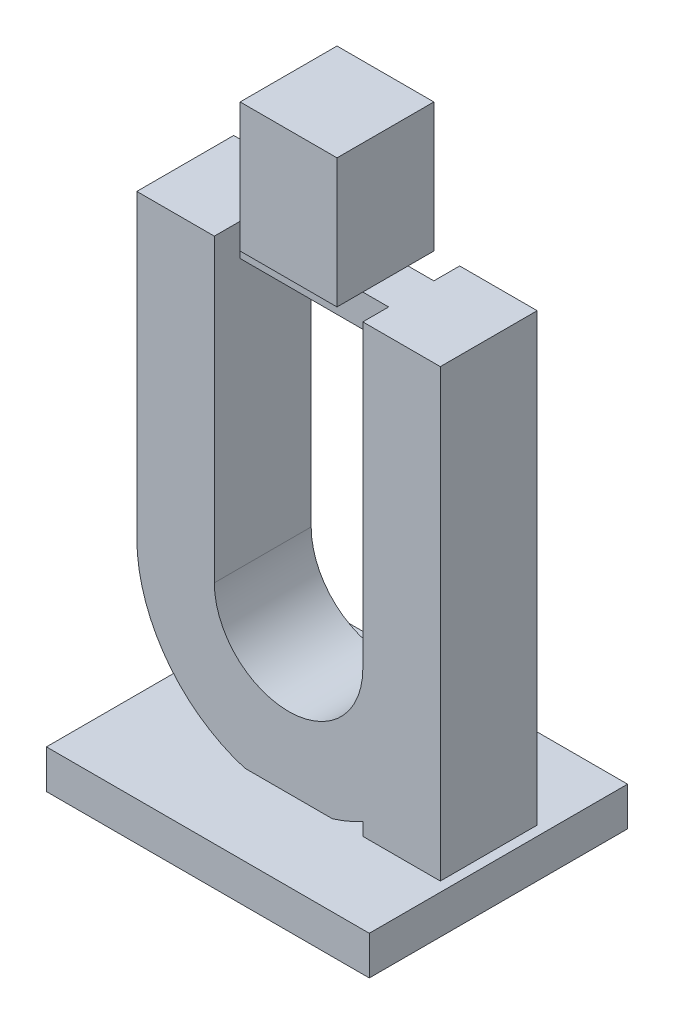
ISO-10303-21;
HEADER;
FILE_DESCRIPTION(('STEP AP214'),'2;1');
FILE_NAME('part.step','',(''),(''),'','','');
FILE_SCHEMA(('AUTOMOTIVE_DESIGN { 1 0 10303 214 1 1 1 1 }'));
ENDSEC;
DATA;
#1=APPLICATION_CONTEXT('core data for automotive mechanical design processes');
#2=APPLICATION_PROTOCOL_DEFINITION('international standard','automotive_design',2000,#1);
#3=PRODUCT_CONTEXT('',#1,'mechanical');
#4=PRODUCT('Part','Part','',(#3));
#5=PRODUCT_RELATED_PRODUCT_CATEGORY('part','',(#4));
#6=PRODUCT_DEFINITION_FORMATION('','',#4);
#7=PRODUCT_DEFINITION_CONTEXT('part definition',#1,'design');
#8=PRODUCT_DEFINITION('design','',#6,#7);
#9=PRODUCT_DEFINITION_SHAPE('','',#8);
#10=(LENGTH_UNIT() NAMED_UNIT(*) SI_UNIT(.MILLI.,.METRE.));
#11=(NAMED_UNIT(*) PLANE_ANGLE_UNIT() SI_UNIT($,.RADIAN.));
#12=(NAMED_UNIT(*) SI_UNIT($,.STERADIAN.) SOLID_ANGLE_UNIT());
#13=UNCERTAINTY_MEASURE_WITH_UNIT(LENGTH_MEASURE(1.E-05),#10,'distance_accuracy_value','');
#14=(GEOMETRIC_REPRESENTATION_CONTEXT(3) GLOBAL_UNCERTAINTY_ASSIGNED_CONTEXT((#13)) GLOBAL_UNIT_ASSIGNED_CONTEXT((#10,
#11,#12)) REPRESENTATION_CONTEXT('',''));
#15=CARTESIAN_POINT('',(0.,0.,0.));
#16=DIRECTION('',(0.,0.,1.));
#17=DIRECTION('',(1.,0.,0.));
#18=AXIS2_PLACEMENT_3D('',#15,#16,#17);
#19=CARTESIAN_POINT('',(-35.,70.,15.));
#20=DIRECTION('',(0.,-1.,0.));
#21=DIRECTION('',(1.,0.,0.));
#22=AXIS2_PLACEMENT_3D('',#19,#20,#21);
#23=PLANE('',#22);
#24=DIRECTION('',(0.,0.,1.));
#25=VECTOR('',#24,1.);
#26=CARTESIAN_POINT('',(-31.0000000000001,70.,0.));
#27=LINE('',#26,#25);
#28=CARTESIAN_POINT('',(-31.0000000000001,70.,4.));
#29=VERTEX_POINT('',#28);
#30=CARTESIAN_POINT('',(-31.0000000000001,70.,11.));
#31=VERTEX_POINT('',#30);
#32=EDGE_CURVE('E11',#29,#31,#27,.T.);
#33=ORIENTED_EDGE('',*,*,#32,.F.);
#34=DIRECTION('',(-1.,0.,0.));
#35=VECTOR('',#34,1.);
#36=CARTESIAN_POINT('',(-35.,70.,4.));
#37=LINE('',#36,#35);
#38=CARTESIAN_POINT('',(-35.,70.,4.));
#39=VERTEX_POINT('',#38);
#40=EDGE_CURVE('E272',#29,#39,#37,.T.);
#41=ORIENTED_EDGE('',*,*,#40,.T.);
#42=DIRECTION('',(0.,0.,-1.));
#43=VECTOR('',#42,1.);
#44=CARTESIAN_POINT('',(-35.,70.,15.));
#45=LINE('',#44,#43);
#46=CARTESIAN_POINT('',(-35.,70.,0.));
#47=VERTEX_POINT('',#46);
#48=EDGE_CURVE('E425',#39,#47,#45,.T.);
#49=ORIENTED_EDGE('',*,*,#48,.T.);
#50=DIRECTION('',(-1.,0.,0.));
#51=VECTOR('',#50,1.);
#52=CARTESIAN_POINT('',(-35.,70.,0.));
#53=LINE('',#52,#51);
#54=CARTESIAN_POINT('',(-47.,70.,0.));
#55=VERTEX_POINT('',#54);
#56=EDGE_CURVE('E400',#47,#55,#53,.T.);
#57=ORIENTED_EDGE('',*,*,#56,.T.);
#58=DIRECTION('',(0.,0.,-1.));
#59=VECTOR('',#58,1.);
#60=CARTESIAN_POINT('',(-47.,70.,15.));
#61=LINE('',#60,#59);
#62=CARTESIAN_POINT('',(-47.,70.,15.));
#63=VERTEX_POINT('',#62);
#64=EDGE_CURVE('E421',#63,#55,#61,.T.);
#65=ORIENTED_EDGE('',*,*,#64,.F.);
#66=DIRECTION('',(-1.,0.,0.));
#67=VECTOR('',#66,1.);
#68=CARTESIAN_POINT('',(-35.,70.,15.));
#69=LINE('',#68,#67);
#70=CARTESIAN_POINT('',(-35.,70.,15.));
#71=VERTEX_POINT('',#70);
#72=EDGE_CURVE('E367',#71,#63,#69,.T.);
#73=ORIENTED_EDGE('',*,*,#72,.F.);
#74=CARTESIAN_POINT('',(-35.,70.,11.));
#75=VERTEX_POINT('',#74);
#76=EDGE_CURVE('E426',#71,#75,#45,.T.);
#77=ORIENTED_EDGE('',*,*,#76,.T.);
#78=DIRECTION('',(1.,0.,0.));
#79=VECTOR('',#78,1.);
#80=CARTESIAN_POINT('',(-35.,70.,11.));
#81=LINE('',#80,#79);
#82=EDGE_CURVE('E249',#75,#31,#81,.T.);
#83=ORIENTED_EDGE('',*,*,#82,.T.);
#84=EDGE_LOOP('',(#33,#41,#49,#57,#65,#73,#77,#83));
#85=FACE_BOUND('',#84,.T.);
#86=ADVANCED_FACE('F39',(#85),#23,.F.);
#87=DIRECTION('',(0.,0.,-1.));
#88=VECTOR('',#87,1.);
#89=CARTESIAN_POINT('',(-16.0000000000001,70.,0.));
#90=LINE('',#89,#88);
#91=CARTESIAN_POINT('',(-16.0000000000001,70.,11.));
#92=VERTEX_POINT('',#91);
#93=CARTESIAN_POINT('',(-16.0000000000001,70.,4.));
#94=VERTEX_POINT('',#93);
#95=EDGE_CURVE('E49',#92,#94,#90,.T.);
#96=ORIENTED_EDGE('',*,*,#95,.F.);
#97=CARTESIAN_POINT('',(-12.,70.,11.));
#98=VERTEX_POINT('',#97);
#99=EDGE_CURVE('E243',#92,#98,#81,.T.);
#100=ORIENTED_EDGE('',*,*,#99,.T.);
#101=DIRECTION('',(0.,0.,-1.));
#102=VECTOR('',#101,1.);
#103=CARTESIAN_POINT('',(-12.,70.,15.));
#104=LINE('',#103,#102);
#105=CARTESIAN_POINT('',(-12.,70.,15.));
#106=VERTEX_POINT('',#105);
#107=EDGE_CURVE('E439',#106,#98,#104,.T.);
#108=ORIENTED_EDGE('',*,*,#107,.F.);
#109=DIRECTION('',(-1.,0.,0.));
#110=VECTOR('',#109,1.);
#111=CARTESIAN_POINT('',(0.,70.,15.));
#112=LINE('',#111,#110);
#113=CARTESIAN_POINT('',(0.,70.,15.));
#114=VERTEX_POINT('',#113);
#115=EDGE_CURVE('E354',#114,#106,#112,.T.);
#116=ORIENTED_EDGE('',*,*,#115,.F.);
#117=DIRECTION('',(0.,0.,-1.));
#118=VECTOR('',#117,1.);
#119=CARTESIAN_POINT('',(0.,70.,15.));
#120=LINE('',#119,#118);
#121=CARTESIAN_POINT('',(0.,70.,0.));
#122=VERTEX_POINT('',#121);
#123=EDGE_CURVE('E442',#114,#122,#120,.T.);
#124=ORIENTED_EDGE('',*,*,#123,.T.);
#125=DIRECTION('',(-1.,0.,0.));
#126=VECTOR('',#125,1.);
#127=CARTESIAN_POINT('',(0.,70.,0.));
#128=LINE('',#127,#126);
#129=CARTESIAN_POINT('',(-12.,70.,0.));
#130=VERTEX_POINT('',#129);
#131=EDGE_CURVE('E386',#122,#130,#128,.T.);
#132=ORIENTED_EDGE('',*,*,#131,.T.);
#133=CARTESIAN_POINT('',(-12.,70.,4.));
#134=VERTEX_POINT('',#133);
#135=EDGE_CURVE('E438',#134,#130,#104,.T.);
#136=ORIENTED_EDGE('',*,*,#135,.F.);
#137=EDGE_CURVE('E259',#134,#94,#37,.T.);
#138=ORIENTED_EDGE('',*,*,#137,.T.);
#139=EDGE_LOOP('',(#96,#100,#108,#116,#124,#132,#136,#138));
#140=FACE_BOUND('',#139,.T.);
#141=ADVANCED_FACE('F539',(#140),#23,.F.);
#142=CARTESIAN_POINT('',(0.,1.,0.));
#143=DIRECTION('',(0.,-1.,0.));
#144=DIRECTION('',(0.,0.,-1.));
#145=AXIS2_PLACEMENT_3D('',#142,#143,#144);
#146=PLANE('',#145);
#147=DIRECTION('',(0.,0.,-1.));
#148=VECTOR('',#147,1.);
#149=CARTESIAN_POINT('',(-48.5,1.,27.5));
#150=LINE('',#149,#148);
#151=CARTESIAN_POINT('',(-48.5,1.,27.5));
#152=VERTEX_POINT('',#151);
#153=CARTESIAN_POINT('',(-48.5,1.,-12.5));
#154=VERTEX_POINT('',#153);
#155=EDGE_CURVE('E307',#152,#154,#150,.T.);
#156=ORIENTED_EDGE('',*,*,#155,.F.);
#157=DIRECTION('',(-1.,0.,0.));
#158=VECTOR('',#157,1.);
#159=CARTESIAN_POINT('',(-48.5,1.,27.5));
#160=LINE('',#159,#158);
#161=CARTESIAN_POINT('',(1.50000000000001,1.,27.5));
#162=VERTEX_POINT('',#161);
#163=EDGE_CURVE('E319',#162,#152,#160,.T.);
#164=ORIENTED_EDGE('',*,*,#163,.F.);
#165=DIRECTION('',(0.,0.,1.));
#166=VECTOR('',#165,1.);
#167=CARTESIAN_POINT('',(1.50000000000001,1.,27.5));
#168=LINE('',#167,#166);
#169=CARTESIAN_POINT('',(1.5,1.,-12.5));
#170=VERTEX_POINT('',#169);
#171=EDGE_CURVE('E315',#170,#162,#168,.T.);
#172=ORIENTED_EDGE('',*,*,#171,.F.);
#173=DIRECTION('',(1.,0.,0.));
#174=VECTOR('',#173,1.);
#175=CARTESIAN_POINT('',(-48.5,1.,-12.5));
#176=LINE('',#175,#174);
#177=EDGE_CURVE('E311',#154,#170,#176,.T.);
#178=ORIENTED_EDGE('',*,*,#177,.F.);
#179=EDGE_LOOP('',(#156,#164,#172,#178));
#180=FACE_BOUND('',#179,.T.);
#181=DIRECTION('',(0.,0.,-1.));
#182=VECTOR('',#181,1.);
#183=CARTESIAN_POINT('',(-16.7176700168747,1.,15.));
#184=LINE('',#183,#182);
#185=CARTESIAN_POINT('',(-16.7176700168747,1.,0.));
#186=VERTEX_POINT('',#185);
#187=CARTESIAN_POINT('',(-16.7176700168747,1.,15.));
#188=VERTEX_POINT('',#187);
#189=EDGE_CURVE('E327',#186,#188,#184,.F.);
#190=ORIENTED_EDGE('',*,*,#189,.T.);
#191=DIRECTION('',(-1.,0.,0.));
#192=VECTOR('',#191,1.);
#193=CARTESIAN_POINT('',(-23.5,1.,15.));
#194=LINE('',#193,#192);
#195=CARTESIAN_POINT('',(-30.2823299831253,1.,15.));
#196=VERTEX_POINT('',#195);
#197=EDGE_CURVE('E341',#188,#196,#194,.T.);
#198=ORIENTED_EDGE('',*,*,#197,.T.);
#199=DIRECTION('',(0.,0.,-1.));
#200=VECTOR('',#199,1.);
#201=CARTESIAN_POINT('',(-30.2823299831253,1.,15.));
#202=LINE('',#201,#200);
#203=CARTESIAN_POINT('',(-30.2823299831253,1.,0.));
#204=VERTEX_POINT('',#203);
#205=EDGE_CURVE('E338',#196,#204,#202,.T.);
#206=ORIENTED_EDGE('',*,*,#205,.T.);
#207=DIRECTION('',(-1.,0.,0.));
#208=VECTOR('',#207,1.);
#209=CARTESIAN_POINT('',(-23.5,1.,0.));
#210=LINE('',#209,#208);
#211=EDGE_CURVE('E43',#186,#204,#210,.T.);
#212=ORIENTED_EDGE('',*,*,#211,.F.);
#213=EDGE_LOOP('',(#190,#198,#206,#212));
#214=FACE_BOUND('',#213,.T.);
#215=DIRECTION('',(0.,0.,1.));
#216=VECTOR('',#215,1.);
#217=CARTESIAN_POINT('',(0.,1.,15.));
#218=LINE('',#217,#216);
#219=CARTESIAN_POINT('',(0.,1.,0.));
#220=VERTEX_POINT('',#219);
#221=CARTESIAN_POINT('',(0.,1.,15.));
#222=VERTEX_POINT('',#221);
#223=EDGE_CURVE('E348',#220,#222,#218,.T.);
#224=ORIENTED_EDGE('',*,*,#223,.T.);
#225=CARTESIAN_POINT('',(-12.,1.,15.));
#226=VERTEX_POINT('',#225);
#227=EDGE_CURVE('E345',#222,#226,#194,.T.);
#228=ORIENTED_EDGE('',*,*,#227,.T.);
#229=DIRECTION('',(0.,0.,-1.));
#230=VECTOR('',#229,1.);
#231=CARTESIAN_POINT('',(-12.,1.,15.));
#232=LINE('',#231,#230);
#233=CARTESIAN_POINT('',(-12.,1.,0.));
#234=VERTEX_POINT('',#233);
#235=EDGE_CURVE('E344',#226,#234,#232,.T.);
#236=ORIENTED_EDGE('',*,*,#235,.T.);
#237=EDGE_CURVE('E450',#220,#234,#210,.T.);
#238=ORIENTED_EDGE('',*,*,#237,.F.);
#239=EDGE_LOOP('',(#224,#228,#236,#238));
#240=FACE_BOUND('',#239,.T.);
#241=ADVANCED_FACE('F512',(#180,#214,#240),#146,.F.);
#242=CARTESIAN_POINT('',(-48.5,1.,27.5));
#243=DIRECTION('',(-1.,0.,0.));
#244=DIRECTION('',(0.,0.,1.));
#245=AXIS2_PLACEMENT_3D('',#242,#243,#244);
#246=PLANE('',#245);
#247=DIRECTION('',(0.,-1.,0.));
#248=VECTOR('',#247,1.);
#249=CARTESIAN_POINT('',(-48.5,1.,-12.5));
#250=LINE('',#249,#248);
#251=CARTESIAN_POINT('',(-48.5,-5.,-12.5));
#252=VERTEX_POINT('',#251);
#253=EDGE_CURVE('E323',#154,#252,#250,.T.);
#254=ORIENTED_EDGE('',*,*,#253,.T.);
#255=DIRECTION('',(0.,0.,-1.));
#256=VECTOR('',#255,1.);
#257=CARTESIAN_POINT('',(-48.5,-5.,27.5));
#258=LINE('',#257,#256);
#259=CARTESIAN_POINT('',(-48.5,-5.,27.5));
#260=VERTEX_POINT('',#259);
#261=EDGE_CURVE('E280',#260,#252,#258,.T.);
#262=ORIENTED_EDGE('',*,*,#261,.F.);
#263=DIRECTION('',(0.,-1.,0.));
#264=VECTOR('',#263,1.);
#265=CARTESIAN_POINT('',(-48.5,1.,27.5));
#266=LINE('',#265,#264);
#267=EDGE_CURVE('E324',#152,#260,#266,.T.);
#268=ORIENTED_EDGE('',*,*,#267,.F.);
#269=ORIENTED_EDGE('',*,*,#155,.T.);
#270=EDGE_LOOP('',(#254,#262,#268,#269));
#271=FACE_BOUND('',#270,.T.);
#272=ADVANCED_FACE('F611',(#271),#246,.T.);
#273=CARTESIAN_POINT('',(-48.5,1.,27.5));
#274=DIRECTION('',(0.,0.,1.));
#275=DIRECTION('',(1.,0.,0.));
#276=AXIS2_PLACEMENT_3D('',#273,#274,#275);
#277=PLANE('',#276);
#278=ORIENTED_EDGE('',*,*,#267,.T.);
#279=DIRECTION('',(-1.,0.,0.));
#280=VECTOR('',#279,1.);
#281=CARTESIAN_POINT('',(-48.5,-5.,27.5));
#282=LINE('',#281,#280);
#283=CARTESIAN_POINT('',(1.50000000000001,-5.,27.5));
#284=VERTEX_POINT('',#283);
#285=EDGE_CURVE('E303',#284,#260,#282,.T.);
#286=ORIENTED_EDGE('',*,*,#285,.F.);
#287=DIRECTION('',(0.,-1.,0.));
#288=VECTOR('',#287,1.);
#289=CARTESIAN_POINT('',(1.50000000000001,1.,27.5));
#290=LINE('',#289,#288);
#291=EDGE_CURVE('E328',#162,#284,#290,.T.);
#292=ORIENTED_EDGE('',*,*,#291,.F.);
#293=ORIENTED_EDGE('',*,*,#163,.T.);
#294=EDGE_LOOP('',(#278,#286,#292,#293));
#295=FACE_BOUND('',#294,.T.);
#296=ADVANCED_FACE('F613',(#295),#277,.T.);
#297=CARTESIAN_POINT('',(1.50000000000001,1.,27.5));
#298=DIRECTION('',(1.,0.,0.));
#299=DIRECTION('',(0.,0.,-1.));
#300=AXIS2_PLACEMENT_3D('',#297,#298,#299);
#301=PLANE('',#300);
#302=ORIENTED_EDGE('',*,*,#291,.T.);
#303=DIRECTION('',(0.,0.,1.));
#304=VECTOR('',#303,1.);
#305=CARTESIAN_POINT('',(1.50000000000001,-5.,27.5));
#306=LINE('',#305,#304);
#307=CARTESIAN_POINT('',(1.5,-5.,-12.5));
#308=VERTEX_POINT('',#307);
#309=EDGE_CURVE('E299',#308,#284,#306,.T.);
#310=ORIENTED_EDGE('',*,*,#309,.F.);
#311=DIRECTION('',(0.,-1.,0.));
#312=VECTOR('',#311,1.);
#313=CARTESIAN_POINT('',(1.5,1.,-12.5));
#314=LINE('',#313,#312);
#315=EDGE_CURVE('E331',#170,#308,#314,.T.);
#316=ORIENTED_EDGE('',*,*,#315,.F.);
#317=ORIENTED_EDGE('',*,*,#171,.T.);
#318=EDGE_LOOP('',(#302,#310,#316,#317));
#319=FACE_BOUND('',#318,.T.);
#320=ADVANCED_FACE('F616',(#319),#301,.T.);
#321=CARTESIAN_POINT('',(-48.5,1.,-12.5));
#322=DIRECTION('',(0.,0.,-1.));
#323=DIRECTION('',(-1.,0.,0.));
#324=AXIS2_PLACEMENT_3D('',#321,#322,#323);
#325=PLANE('',#324);
#326=ORIENTED_EDGE('',*,*,#315,.T.);
#327=DIRECTION('',(1.,0.,0.));
#328=VECTOR('',#327,1.);
#329=CARTESIAN_POINT('',(-48.5,-5.,-12.5));
#330=LINE('',#329,#328);
#331=EDGE_CURVE('E295',#252,#308,#330,.T.);
#332=ORIENTED_EDGE('',*,*,#331,.F.);
#333=ORIENTED_EDGE('',*,*,#253,.F.);
#334=ORIENTED_EDGE('',*,*,#177,.T.);
#335=EDGE_LOOP('',(#326,#332,#333,#334));
#336=FACE_BOUND('',#335,.T.);
#337=ADVANCED_FACE('F607',(#336),#325,.T.);
#338=CARTESIAN_POINT('',(0.,-5.,0.));
#339=DIRECTION('',(0.,-1.,0.));
#340=DIRECTION('',(0.,0.,-1.));
#341=AXIS2_PLACEMENT_3D('',#338,#339,#340);
#342=PLANE('',#341);
#343=ORIENTED_EDGE('',*,*,#261,.T.);
#344=ORIENTED_EDGE('',*,*,#331,.T.);
#345=ORIENTED_EDGE('',*,*,#309,.T.);
#346=ORIENTED_EDGE('',*,*,#285,.T.);
#347=EDGE_LOOP('',(#343,#344,#345,#346));
#348=FACE_BOUND('',#347,.T.);
#349=ADVANCED_FACE('F604',(#348),#342,.T.);
#350=CARTESIAN_POINT('',(0.,0.,15.));
#351=DIRECTION('',(-1.,0.,0.));
#352=DIRECTION('',(0.,0.,1.));
#353=AXIS2_PLACEMENT_3D('',#350,#351,#352);
#354=PLANE('',#353);
#355=ORIENTED_EDGE('',*,*,#223,.F.);
#356=DIRECTION('',(0.,1.,0.));
#357=VECTOR('',#356,1.);
#358=CARTESIAN_POINT('',(0.,0.,0.));
#359=LINE('',#358,#357);
#360=EDGE_CURVE('E383',#220,#122,#359,.T.);
#361=ORIENTED_EDGE('',*,*,#360,.T.);
#362=ORIENTED_EDGE('',*,*,#123,.F.);
#363=DIRECTION('',(0.,1.,0.));
#364=VECTOR('',#363,1.);
#365=CARTESIAN_POINT('',(0.,0.,15.));
#366=LINE('',#365,#364);
#367=EDGE_CURVE('E351',#222,#114,#366,.T.);
#368=ORIENTED_EDGE('',*,*,#367,.F.);
#369=EDGE_LOOP('',(#355,#361,#362,#368));
#370=FACE_BOUND('',#369,.T.);
#371=ADVANCED_FACE('F41',(#370),#354,.F.);
#372=CARTESIAN_POINT('',(-23.5,23.5,15.));
#373=DIRECTION('',(0.,0.,-1.));
#374=DIRECTION('',(-1.,0.,0.));
#375=AXIS2_PLACEMENT_3D('',#372,#373,#374);
#376=CYLINDRICAL_SURFACE('',#375,23.5);
#377=ORIENTED_EDGE('',*,*,#205,.F.);
#378=CARTESIAN_POINT('',(-23.5,23.5,15.));
#379=DIRECTION('',(0.,0.,1.));
#380=DIRECTION('',(1.,0.,0.));
#381=AXIS2_PLACEMENT_3D('',#378,#379,#380);
#382=CIRCLE('',#381,23.5);
#383=CARTESIAN_POINT('',(-47.,23.5,15.));
#384=VERTEX_POINT('',#383);
#385=EDGE_CURVE('E374',#384,#196,#382,.T.);
#386=ORIENTED_EDGE('',*,*,#385,.F.);
#387=DIRECTION('',(0.,0.,-1.));
#388=VECTOR('',#387,1.);
#389=CARTESIAN_POINT('',(-47.,23.5,15.));
#390=LINE('',#389,#388);
#391=CARTESIAN_POINT('',(-47.,23.5,0.));
#392=VERTEX_POINT('',#391);
#393=EDGE_CURVE('E417',#384,#392,#390,.T.);
#394=ORIENTED_EDGE('',*,*,#393,.T.);
#395=CARTESIAN_POINT('',(-23.5,23.5,0.));
#396=DIRECTION('',(0.,0.,1.));
#397=DIRECTION('',(1.,0.,0.));
#398=AXIS2_PLACEMENT_3D('',#395,#396,#397);
#399=CIRCLE('',#398,23.5);
#400=EDGE_CURVE('E407',#392,#204,#399,.T.);
#401=ORIENTED_EDGE('',*,*,#400,.T.);
#402=EDGE_LOOP('',(#377,#386,#394,#401));
#403=FACE_BOUND('',#402,.T.);
#404=ADVANCED_FACE('F639',(#403),#376,.T.);
#405=ORIENTED_EDGE('',*,*,#189,.F.);
#406=CARTESIAN_POINT('',(-12.,3.00609846808081,0.));
#407=VERTEX_POINT('',#406);
#408=EDGE_CURVE('E406',#186,#407,#399,.T.);
#409=ORIENTED_EDGE('',*,*,#408,.T.);
#410=DIRECTION('',(0.,0.,-1.));
#411=VECTOR('',#410,1.);
#412=CARTESIAN_POINT('',(-12.,3.00609846808081,15.));
#413=LINE('',#412,#411);
#414=CARTESIAN_POINT('',(-12.,3.00609846808081,15.));
#415=VERTEX_POINT('',#414);
#416=EDGE_CURVE('E382',#415,#407,#413,.T.);
#417=ORIENTED_EDGE('',*,*,#416,.F.);
#418=EDGE_CURVE('E373',#188,#415,#382,.T.);
#419=ORIENTED_EDGE('',*,*,#418,.F.);
#420=EDGE_LOOP('',(#405,#409,#417,#419));
#421=FACE_BOUND('',#420,.T.);
#422=ADVANCED_FACE('F525',(#421),#376,.T.);
#423=CARTESIAN_POINT('',(-12.,3.00609846808079,15.));
#424=DIRECTION('',(1.,0.,0.));
#425=DIRECTION('',(0.,0.,-1.));
#426=AXIS2_PLACEMENT_3D('',#423,#424,#425);
#427=PLANE('',#426);
#428=ORIENTED_EDGE('',*,*,#235,.F.);
#429=DIRECTION('',(0.,-1.,0.));
#430=VECTOR('',#429,1.);
#431=CARTESIAN_POINT('',(-12.,3.00609846808079,15.));
#432=LINE('',#431,#430);
#433=EDGE_CURVE('E378',#415,#226,#432,.T.);
#434=ORIENTED_EDGE('',*,*,#433,.F.);
#435=ORIENTED_EDGE('',*,*,#416,.T.);
#436=DIRECTION('',(0.,-1.,0.));
#437=VECTOR('',#436,1.);
#438=CARTESIAN_POINT('',(-12.,3.00609846808079,0.));
#439=LINE('',#438,#437);
#440=EDGE_CURVE('E355',#407,#234,#439,.T.);
#441=ORIENTED_EDGE('',*,*,#440,.T.);
#442=EDGE_LOOP('',(#428,#434,#435,#441));
#443=FACE_BOUND('',#442,.T.);
#444=ADVANCED_FACE('F518',(#443),#427,.F.);
#445=CARTESIAN_POINT('',(-23.5,23.5,15.));
#446=DIRECTION('',(0.,0.,-1.));
#447=DIRECTION('',(-1.,0.,0.));
#448=AXIS2_PLACEMENT_3D('',#445,#446,#447);
#449=PLANE('',#448);
#450=ORIENTED_EDGE('',*,*,#227,.F.);
#451=ORIENTED_EDGE('',*,*,#367,.T.);
#452=ORIENTED_EDGE('',*,*,#115,.T.);
#453=DIRECTION('',(0.,-1.,0.));
#454=VECTOR('',#453,1.);
#455=CARTESIAN_POINT('',(-12.,70.,15.));
#456=LINE('',#455,#454);
#457=CARTESIAN_POINT('',(-12.,23.5,15.));
#458=VERTEX_POINT('',#457);
#459=EDGE_CURVE('E358',#106,#458,#456,.T.);
#460=ORIENTED_EDGE('',*,*,#459,.T.);
#461=CARTESIAN_POINT('',(-23.5,23.5,15.));
#462=DIRECTION('',(0.,0.,-1.));
#463=DIRECTION('',(-1.,0.,0.));
#464=AXIS2_PLACEMENT_3D('',#461,#462,#463);
#465=CIRCLE('',#464,11.5);
#466=CARTESIAN_POINT('',(-35.,23.5,15.));
#467=VERTEX_POINT('',#466);
#468=EDGE_CURVE('E361',#458,#467,#465,.T.);
#469=ORIENTED_EDGE('',*,*,#468,.T.);
#470=DIRECTION('',(0.,1.,0.));
#471=VECTOR('',#470,1.);
#472=CARTESIAN_POINT('',(-35.,23.5,15.));
#473=LINE('',#472,#471);
#474=EDGE_CURVE('E364',#467,#71,#473,.T.);
#475=ORIENTED_EDGE('',*,*,#474,.T.);
#476=ORIENTED_EDGE('',*,*,#72,.T.);
#477=DIRECTION('',(0.,-1.,0.));
#478=VECTOR('',#477,1.);
#479=CARTESIAN_POINT('',(-47.,70.,15.));
#480=LINE('',#479,#478);
#481=EDGE_CURVE('E370',#63,#384,#480,.T.);
#482=ORIENTED_EDGE('',*,*,#481,.T.);
#483=ORIENTED_EDGE('',*,*,#385,.T.);
#484=ORIENTED_EDGE('',*,*,#197,.F.);
#485=ORIENTED_EDGE('',*,*,#418,.T.);
#486=ORIENTED_EDGE('',*,*,#433,.T.);
#487=EDGE_LOOP('',(#450,#451,#452,#460,#469,#475,#476,#482,#483,#484,#485,#486));
#488=FACE_BOUND('',#487,.T.);
#489=ADVANCED_FACE('F519',(#488),#449,.F.);
#490=CARTESIAN_POINT('',(-23.5,23.5,0.));
#491=DIRECTION('',(0.,0.,-1.));
#492=DIRECTION('',(-1.,0.,0.));
#493=AXIS2_PLACEMENT_3D('',#490,#491,#492);
#494=PLANE('',#493);
#495=ORIENTED_EDGE('',*,*,#360,.F.);
#496=ORIENTED_EDGE('',*,*,#237,.T.);
#497=ORIENTED_EDGE('',*,*,#440,.F.);
#498=ORIENTED_EDGE('',*,*,#408,.F.);
#499=ORIENTED_EDGE('',*,*,#211,.T.);
#500=ORIENTED_EDGE('',*,*,#400,.F.);
#501=DIRECTION('',(0.,-1.,0.));
#502=VECTOR('',#501,1.);
#503=CARTESIAN_POINT('',(-47.,70.,0.));
#504=LINE('',#503,#502);
#505=EDGE_CURVE('E403',#55,#392,#504,.T.);
#506=ORIENTED_EDGE('',*,*,#505,.F.);
#507=ORIENTED_EDGE('',*,*,#56,.F.);
#508=DIRECTION('',(0.,1.,0.));
#509=VECTOR('',#508,1.);
#510=CARTESIAN_POINT('',(-35.,23.5,0.));
#511=LINE('',#510,#509);
#512=CARTESIAN_POINT('',(-35.,23.5,0.));
#513=VERTEX_POINT('',#512);
#514=EDGE_CURVE('E396',#513,#47,#511,.T.);
#515=ORIENTED_EDGE('',*,*,#514,.F.);
#516=CARTESIAN_POINT('',(-23.5,23.5,0.));
#517=DIRECTION('',(0.,0.,-1.));
#518=DIRECTION('',(-1.,0.,0.));
#519=AXIS2_PLACEMENT_3D('',#516,#517,#518);
#520=CIRCLE('',#519,11.5);
#521=CARTESIAN_POINT('',(-12.,23.5,0.));
#522=VERTEX_POINT('',#521);
#523=EDGE_CURVE('E393',#522,#513,#520,.T.);
#524=ORIENTED_EDGE('',*,*,#523,.F.);
#525=DIRECTION('',(0.,-1.,0.));
#526=VECTOR('',#525,1.);
#527=CARTESIAN_POINT('',(-12.,70.,0.));
#528=LINE('',#527,#526);
#529=EDGE_CURVE('E390',#130,#522,#528,.T.);
#530=ORIENTED_EDGE('',*,*,#529,.F.);
#531=ORIENTED_EDGE('',*,*,#131,.F.);
#532=EDGE_LOOP('',(#495,#496,#497,#498,#499,#500,#506,#507,#515,#524,#530,#531));
#533=FACE_BOUND('',#532,.T.);
#534=ADVANCED_FACE('F526',(#533),#494,.T.);
#535=CARTESIAN_POINT('',(-12.,70.,15.));
#536=DIRECTION('',(1.,0.,0.));
#537=DIRECTION('',(0.,1.,0.));
#538=AXIS2_PLACEMENT_3D('',#535,#536,#537);
#539=PLANE('',#538);
#540=DIRECTION('',(0.,0.,-1.));
#541=VECTOR('',#540,1.);
#542=CARTESIAN_POINT('',(-12.,65.,4.));
#543=LINE('',#542,#541);
#544=CARTESIAN_POINT('',(-12.,65.,11.));
#545=VERTEX_POINT('',#544);
#546=CARTESIAN_POINT('',(-12.,65.,4.));
#547=VERTEX_POINT('',#546);
#548=EDGE_CURVE('E263',#545,#547,#543,.T.);
#549=ORIENTED_EDGE('',*,*,#548,.T.);
#550=DIRECTION('',(0.,1.,0.));
#551=VECTOR('',#550,1.);
#552=CARTESIAN_POINT('',(-12.,65.,4.));
#553=LINE('',#552,#551);
#554=EDGE_CURVE('E281',#547,#134,#553,.T.);
#555=ORIENTED_EDGE('',*,*,#554,.T.);
#556=ORIENTED_EDGE('',*,*,#135,.T.);
#557=ORIENTED_EDGE('',*,*,#529,.T.);
#558=DIRECTION('',(0.,0.,-1.));
#559=VECTOR('',#558,1.);
#560=CARTESIAN_POINT('',(-12.,23.5,15.));
#561=LINE('',#560,#559);
#562=EDGE_CURVE('E434',#458,#522,#561,.T.);
#563=ORIENTED_EDGE('',*,*,#562,.F.);
#564=ORIENTED_EDGE('',*,*,#459,.F.);
#565=ORIENTED_EDGE('',*,*,#107,.T.);
#566=DIRECTION('',(0.,1.,0.));
#567=VECTOR('',#566,1.);
#568=CARTESIAN_POINT('',(-12.,65.,11.));
#569=LINE('',#568,#567);
#570=EDGE_CURVE('E285',#545,#98,#569,.T.);
#571=ORIENTED_EDGE('',*,*,#570,.F.);
#572=EDGE_LOOP('',(#549,#555,#556,#557,#563,#564,#565,#571));
#573=FACE_BOUND('',#572,.T.);
#574=ADVANCED_FACE('F528',(#573),#539,.F.);
#575=CARTESIAN_POINT('',(-23.5,23.5,15.));
#576=DIRECTION('',(0.,0.,-1.));
#577=DIRECTION('',(-1.,0.,0.));
#578=AXIS2_PLACEMENT_3D('',#575,#576,#577);
#579=CYLINDRICAL_SURFACE('',#578,11.5);
#580=ORIENTED_EDGE('',*,*,#523,.T.);
#581=DIRECTION('',(0.,0.,-1.));
#582=VECTOR('',#581,1.);
#583=CARTESIAN_POINT('',(-35.,23.5,15.));
#584=LINE('',#583,#582);
#585=EDGE_CURVE('E430',#467,#513,#584,.T.);
#586=ORIENTED_EDGE('',*,*,#585,.F.);
#587=ORIENTED_EDGE('',*,*,#468,.F.);
#588=ORIENTED_EDGE('',*,*,#562,.T.);
#589=EDGE_LOOP('',(#580,#586,#587,#588));
#590=FACE_BOUND('',#589,.T.);
#591=ADVANCED_FACE('F534',(#590),#579,.F.);
#592=CARTESIAN_POINT('',(-35.,23.5,15.));
#593=DIRECTION('',(-1.,0.,0.));
#594=DIRECTION('',(0.,-1.,0.));
#595=AXIS2_PLACEMENT_3D('',#592,#593,#594);
#596=PLANE('',#595);
#597=ORIENTED_EDGE('',*,*,#48,.F.);
#598=DIRECTION('',(0.,1.,0.));
#599=VECTOR('',#598,1.);
#600=CARTESIAN_POINT('',(-35.,65.,4.));
#601=LINE('',#600,#599);
#602=CARTESIAN_POINT('',(-35.,65.,4.));
#603=VERTEX_POINT('',#602);
#604=EDGE_CURVE('E276',#603,#39,#601,.T.);
#605=ORIENTED_EDGE('',*,*,#604,.F.);
#606=DIRECTION('',(0.,0.,1.));
#607=VECTOR('',#606,1.);
#608=CARTESIAN_POINT('',(-35.,65.,4.));
#609=LINE('',#608,#607);
#610=CARTESIAN_POINT('',(-35.,65.,11.));
#611=VERTEX_POINT('',#610);
#612=EDGE_CURVE('E254',#603,#611,#609,.T.);
#613=ORIENTED_EDGE('',*,*,#612,.T.);
#614=DIRECTION('',(0.,1.,0.));
#615=VECTOR('',#614,1.);
#616=CARTESIAN_POINT('',(-35.,65.,11.));
#617=LINE('',#616,#615);
#618=EDGE_CURVE('E269',#611,#75,#617,.T.);
#619=ORIENTED_EDGE('',*,*,#618,.T.);
#620=ORIENTED_EDGE('',*,*,#76,.F.);
#621=ORIENTED_EDGE('',*,*,#474,.F.);
#622=ORIENTED_EDGE('',*,*,#585,.T.);
#623=ORIENTED_EDGE('',*,*,#514,.T.);
#624=EDGE_LOOP('',(#597,#605,#613,#619,#620,#621,#622,#623));
#625=FACE_BOUND('',#624,.T.);
#626=ADVANCED_FACE('F502',(#625),#596,.F.);
#627=CARTESIAN_POINT('',(-47.,70.,15.));
#628=DIRECTION('',(1.,0.,0.));
#629=DIRECTION('',(0.,1.,0.));
#630=AXIS2_PLACEMENT_3D('',#627,#628,#629);
#631=PLANE('',#630);
#632=ORIENTED_EDGE('',*,*,#505,.T.);
#633=ORIENTED_EDGE('',*,*,#393,.F.);
#634=ORIENTED_EDGE('',*,*,#481,.F.);
#635=ORIENTED_EDGE('',*,*,#64,.T.);
#636=EDGE_LOOP('',(#632,#633,#634,#635));
#637=FACE_BOUND('',#636,.T.);
#638=ADVANCED_FACE('F546',(#637),#631,.F.);
#639=CARTESIAN_POINT('',(-35.,65.,4.));
#640=DIRECTION('',(0.,0.,-1.));
#641=DIRECTION('',(-1.,0.,0.));
#642=AXIS2_PLACEMENT_3D('',#639,#640,#641);
#643=PLANE('',#642);
#644=ORIENTED_EDGE('',*,*,#137,.F.);
#645=ORIENTED_EDGE('',*,*,#554,.F.);
#646=DIRECTION('',(-1.,0.,0.));
#647=VECTOR('',#646,1.);
#648=CARTESIAN_POINT('',(-35.,65.,4.));
#649=LINE('',#648,#647);
#650=EDGE_CURVE('E266',#547,#603,#649,.T.);
#651=ORIENTED_EDGE('',*,*,#650,.T.);
#652=ORIENTED_EDGE('',*,*,#604,.T.);
#653=ORIENTED_EDGE('',*,*,#40,.F.);
#654=EDGE_CURVE('E275',#94,#29,#37,.T.);
#655=ORIENTED_EDGE('',*,*,#654,.F.);
#656=EDGE_LOOP('',(#644,#645,#651,#652,#653,#655));
#657=FACE_BOUND('',#656,.T.);
#658=ADVANCED_FACE('F498',(#657),#643,.T.);
#659=CARTESIAN_POINT('',(-35.,65.,11.));
#660=DIRECTION('',(0.,0.,1.));
#661=DIRECTION('',(1.,0.,0.));
#662=AXIS2_PLACEMENT_3D('',#659,#660,#661);
#663=PLANE('',#662);
#664=ORIENTED_EDGE('',*,*,#82,.F.);
#665=ORIENTED_EDGE('',*,*,#618,.F.);
#666=DIRECTION('',(1.,0.,0.));
#667=VECTOR('',#666,1.);
#668=CARTESIAN_POINT('',(-35.,65.,11.));
#669=LINE('',#668,#667);
#670=EDGE_CURVE('E258',#611,#545,#669,.T.);
#671=ORIENTED_EDGE('',*,*,#670,.T.);
#672=ORIENTED_EDGE('',*,*,#570,.T.);
#673=ORIENTED_EDGE('',*,*,#99,.F.);
#674=EDGE_CURVE('E247',#31,#92,#81,.T.);
#675=ORIENTED_EDGE('',*,*,#674,.F.);
#676=EDGE_LOOP('',(#664,#665,#671,#672,#673,#675));
#677=FACE_BOUND('',#676,.T.);
#678=ADVANCED_FACE('F570',(#677),#663,.T.);
#679=CARTESIAN_POINT('',(0.,65.,0.));
#680=DIRECTION('',(0.,1.,0.));
#681=DIRECTION('',(0.,0.,1.));
#682=AXIS2_PLACEMENT_3D('',#679,#680,#681);
#683=PLANE('',#682);
#684=ORIENTED_EDGE('',*,*,#612,.F.);
#685=ORIENTED_EDGE('',*,*,#650,.F.);
#686=ORIENTED_EDGE('',*,*,#548,.F.);
#687=ORIENTED_EDGE('',*,*,#670,.F.);
#688=EDGE_LOOP('',(#684,#685,#686,#687));
#689=FACE_BOUND('',#688,.T.);
#690=ADVANCED_FACE('F573',(#689),#683,.F.);
#691=CARTESIAN_POINT('',(-1.29526019539602E-13,70.0000000000001,0.));
#692=DIRECTION('',(0.,1.,0.));
#693=DIRECTION('',(-1.,0.,0.));
#694=AXIS2_PLACEMENT_3D('',#691,#692,#693);
#695=PLANE('',#694);
#696=CARTESIAN_POINT('',(-31.0000000000001,70.,15.));
#697=VERTEX_POINT('',#696);
#698=EDGE_CURVE('E52',#31,#697,#27,.T.);
#699=ORIENTED_EDGE('',*,*,#698,.F.);
#700=ORIENTED_EDGE('',*,*,#674,.T.);
#701=CARTESIAN_POINT('',(-16.0000000000001,70.,15.));
#702=VERTEX_POINT('',#701);
#703=EDGE_CURVE('E460',#702,#92,#90,.T.);
#704=ORIENTED_EDGE('',*,*,#703,.F.);
#705=DIRECTION('',(1.,0.,0.));
#706=VECTOR('',#705,1.);
#707=CARTESIAN_POINT('',(-31.0000000000001,70.,15.));
#708=LINE('',#707,#706);
#709=EDGE_CURVE('E468',#697,#702,#708,.T.);
#710=ORIENTED_EDGE('',*,*,#709,.F.);
#711=EDGE_LOOP('',(#699,#700,#704,#710));
#712=FACE_BOUND('',#711,.T.);
#713=ADVANCED_FACE('F580',(#712),#695,.F.);
#714=CARTESIAN_POINT('',(-16.0000000000001,70.,0.));
#715=VERTEX_POINT('',#714);
#716=EDGE_CURVE('E461',#94,#715,#90,.T.);
#717=ORIENTED_EDGE('',*,*,#716,.F.);
#718=ORIENTED_EDGE('',*,*,#654,.T.);
#719=CARTESIAN_POINT('',(-31.0000000000001,70.,0.));
#720=VERTEX_POINT('',#719);
#721=EDGE_CURVE('E51',#720,#29,#27,.T.);
#722=ORIENTED_EDGE('',*,*,#721,.F.);
#723=DIRECTION('',(-1.,0.,0.));
#724=VECTOR('',#723,1.);
#725=CARTESIAN_POINT('',(-31.0000000000001,70.,0.));
#726=LINE('',#725,#724);
#727=EDGE_CURVE('E236',#715,#720,#726,.T.);
#728=ORIENTED_EDGE('',*,*,#727,.F.);
#729=EDGE_LOOP('',(#717,#718,#722,#728));
#730=FACE_BOUND('',#729,.T.);
#731=ADVANCED_FACE('F490',(#730),#695,.F.);
#732=CARTESIAN_POINT('',(-31.0000000000001,90.,0.));
#733=DIRECTION('',(1.,0.,0.));
#734=DIRECTION('',(0.,1.,0.));
#735=AXIS2_PLACEMENT_3D('',#732,#733,#734);
#736=PLANE('',#735);
#737=ORIENTED_EDGE('',*,*,#721,.T.);
#738=ORIENTED_EDGE('',*,*,#32,.T.);
#739=ORIENTED_EDGE('',*,*,#698,.T.);
#740=DIRECTION('',(0.,-1.,0.));
#741=VECTOR('',#740,1.);
#742=CARTESIAN_POINT('',(-31.0000000000001,90.,15.));
#743=LINE('',#742,#741);
#744=CARTESIAN_POINT('',(-31.0000000000001,90.,15.));
#745=VERTEX_POINT('',#744);
#746=EDGE_CURVE('E219',#745,#697,#743,.T.);
#747=ORIENTED_EDGE('',*,*,#746,.F.);
#748=DIRECTION('',(0.,0.,1.));
#749=VECTOR('',#748,1.);
#750=CARTESIAN_POINT('',(-31.0000000000001,90.,0.));
#751=LINE('',#750,#749);
#752=CARTESIAN_POINT('',(-31.0000000000001,90.,0.));
#753=VERTEX_POINT('',#752);
#754=EDGE_CURVE('E226',#753,#745,#751,.T.);
#755=ORIENTED_EDGE('',*,*,#754,.F.);
#756=DIRECTION('',(0.,-1.,0.));
#757=VECTOR('',#756,1.);
#758=CARTESIAN_POINT('',(-31.0000000000001,90.,0.));
#759=LINE('',#758,#757);
#760=EDGE_CURVE('E477',#753,#720,#759,.T.);
#761=ORIENTED_EDGE('',*,*,#760,.T.);
#762=EDGE_LOOP('',(#737,#738,#739,#747,#755,#761));
#763=FACE_BOUND('',#762,.T.);
#764=ADVANCED_FACE('F239',(#763),#736,.F.);
#765=CARTESIAN_POINT('',(-31.0000000000001,90.,15.));
#766=DIRECTION('',(0.,0.,-1.));
#767=DIRECTION('',(-1.,0.,0.));
#768=AXIS2_PLACEMENT_3D('',#765,#766,#767);
#769=PLANE('',#768);
#770=ORIENTED_EDGE('',*,*,#709,.T.);
#771=DIRECTION('',(0.,-1.,0.));
#772=VECTOR('',#771,1.);
#773=CARTESIAN_POINT('',(-16.0000000000001,90.0000000000001,15.));
#774=LINE('',#773,#772);
#775=CARTESIAN_POINT('',(-16.0000000000001,90.0000000000001,15.));
#776=VERTEX_POINT('',#775);
#777=EDGE_CURVE('E221',#776,#702,#774,.T.);
#778=ORIENTED_EDGE('',*,*,#777,.F.);
#779=DIRECTION('',(1.,0.,0.));
#780=VECTOR('',#779,1.);
#781=CARTESIAN_POINT('',(-31.0000000000001,90.,15.));
#782=LINE('',#781,#780);
#783=EDGE_CURVE('E215',#745,#776,#782,.T.);
#784=ORIENTED_EDGE('',*,*,#783,.F.);
#785=ORIENTED_EDGE('',*,*,#746,.T.);
#786=EDGE_LOOP('',(#770,#778,#784,#785));
#787=FACE_BOUND('',#786,.T.);
#788=ADVANCED_FACE('F217',(#787),#769,.F.);
#789=CARTESIAN_POINT('',(-16.0000000000001,90.0000000000001,0.));
#790=DIRECTION('',(-1.,0.,0.));
#791=DIRECTION('',(0.,-1.,0.));
#792=AXIS2_PLACEMENT_3D('',#789,#790,#791);
#793=PLANE('',#792);
#794=ORIENTED_EDGE('',*,*,#703,.T.);
#795=ORIENTED_EDGE('',*,*,#95,.T.);
#796=ORIENTED_EDGE('',*,*,#716,.T.);
#797=DIRECTION('',(0.,-1.,0.));
#798=VECTOR('',#797,1.);
#799=CARTESIAN_POINT('',(-16.0000000000001,90.0000000000001,0.));
#800=LINE('',#799,#798);
#801=CARTESIAN_POINT('',(-16.0000000000001,90.0000000000001,0.));
#802=VERTEX_POINT('',#801);
#803=EDGE_CURVE('E250',#802,#715,#800,.T.);
#804=ORIENTED_EDGE('',*,*,#803,.F.);
#805=DIRECTION('',(0.,0.,-1.));
#806=VECTOR('',#805,1.);
#807=CARTESIAN_POINT('',(-16.0000000000001,90.0000000000001,0.));
#808=LINE('',#807,#806);
#809=EDGE_CURVE('E225',#776,#802,#808,.T.);
#810=ORIENTED_EDGE('',*,*,#809,.F.);
#811=ORIENTED_EDGE('',*,*,#777,.T.);
#812=EDGE_LOOP('',(#794,#795,#796,#804,#810,#811));
#813=FACE_BOUND('',#812,.T.);
#814=ADVANCED_FACE('F479',(#813),#793,.F.);
#815=CARTESIAN_POINT('',(-31.0000000000001,90.,0.));
#816=DIRECTION('',(0.,0.,1.));
#817=DIRECTION('',(1.,0.,0.));
#818=AXIS2_PLACEMENT_3D('',#815,#816,#817);
#819=PLANE('',#818);
#820=ORIENTED_EDGE('',*,*,#727,.T.);
#821=ORIENTED_EDGE('',*,*,#760,.F.);
#822=DIRECTION('',(-1.,0.,0.));
#823=VECTOR('',#822,1.);
#824=CARTESIAN_POINT('',(-31.0000000000001,90.,0.));
#825=LINE('',#824,#823);
#826=EDGE_CURVE('E231',#802,#753,#825,.T.);
#827=ORIENTED_EDGE('',*,*,#826,.F.);
#828=ORIENTED_EDGE('',*,*,#803,.T.);
#829=EDGE_LOOP('',(#820,#821,#827,#828));
#830=FACE_BOUND('',#829,.T.);
#831=ADVANCED_FACE('F483',(#830),#819,.F.);
#832=CARTESIAN_POINT('',(-1.52655665885959E-13,90.0000000000001,0.));
#833=DIRECTION('',(0.,1.,0.));
#834=DIRECTION('',(-1.,0.,0.));
#835=AXIS2_PLACEMENT_3D('',#832,#833,#834);
#836=PLANE('',#835);
#837=ORIENTED_EDGE('',*,*,#754,.T.);
#838=ORIENTED_EDGE('',*,*,#783,.T.);
#839=ORIENTED_EDGE('',*,*,#809,.T.);
#840=ORIENTED_EDGE('',*,*,#826,.T.);
#841=EDGE_LOOP('',(#837,#838,#839,#840));
#842=FACE_BOUND('',#841,.T.);
#843=ADVANCED_FACE('F229',(#842),#836,.T.);
#844=CLOSED_SHELL('',(#86,#141,#241,#272,#296,#320,#337,#349,#371,#404,#422,#444,#489,#534,#574,
#591,#626,#638,#658,#678,#690,#713,#731,#764,#788,#814,#831,#843));
#845=MANIFOLD_SOLID_BREP('B2',#844);
#846=ADVANCED_BREP_SHAPE_REPRESENTATION('',(#18,#845),#14);
#847=SHAPE_DEFINITION_REPRESENTATION(#9,#846);
ENDSEC;
END-ISO-10303-21;
